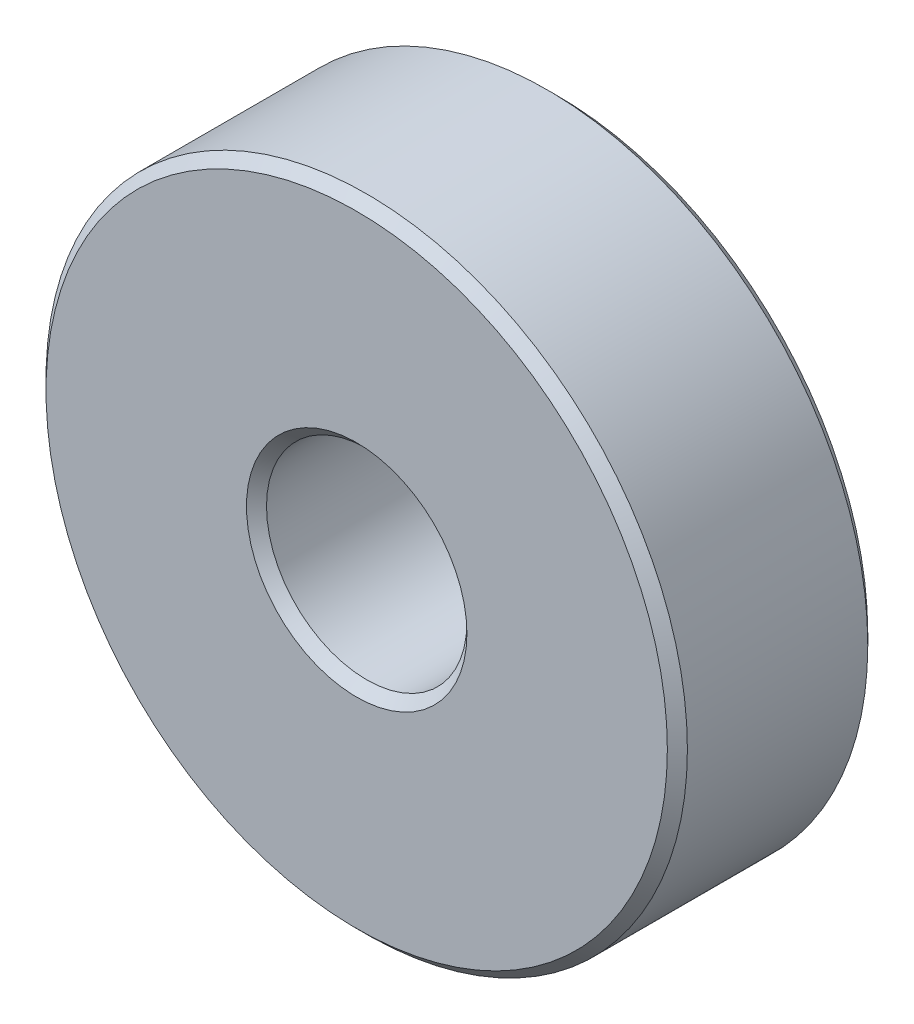
ISO-10303-21;
HEADER;
FILE_DESCRIPTION(('STEP AP214'),'2;1');
FILE_NAME('part.step','',(''),(''),'','','');
FILE_SCHEMA(('AUTOMOTIVE_DESIGN { 1 0 10303 214 1 1 1 1 }'));
ENDSEC;
DATA;
#1=APPLICATION_CONTEXT('core data for automotive mechanical design processes');
#2=APPLICATION_PROTOCOL_DEFINITION('international standard','automotive_design',2000,#1);
#3=PRODUCT_CONTEXT('',#1,'mechanical');
#4=PRODUCT('Part','Part','',(#3));
#5=PRODUCT_RELATED_PRODUCT_CATEGORY('part','',(#4));
#6=PRODUCT_DEFINITION_FORMATION('','',#4);
#7=PRODUCT_DEFINITION_CONTEXT('part definition',#1,'design');
#8=PRODUCT_DEFINITION('design','',#6,#7);
#9=PRODUCT_DEFINITION_SHAPE('','',#8);
#10=(LENGTH_UNIT() NAMED_UNIT(*) SI_UNIT(.MILLI.,.METRE.));
#11=(NAMED_UNIT(*) PLANE_ANGLE_UNIT() SI_UNIT($,.RADIAN.));
#12=(NAMED_UNIT(*) SI_UNIT($,.STERADIAN.) SOLID_ANGLE_UNIT());
#13=UNCERTAINTY_MEASURE_WITH_UNIT(LENGTH_MEASURE(1.E-05),#10,'distance_accuracy_value','');
#14=(GEOMETRIC_REPRESENTATION_CONTEXT(3) GLOBAL_UNCERTAINTY_ASSIGNED_CONTEXT((#13)) GLOBAL_UNIT_ASSIGNED_CONTEXT((#10,
#11,#12)) REPRESENTATION_CONTEXT('',''));
#15=CARTESIAN_POINT('',(0.,0.,0.));
#16=DIRECTION('',(0.,0.,1.));
#17=DIRECTION('',(1.,0.,0.));
#18=AXIS2_PLACEMENT_3D('',#15,#16,#17);
#19=CARTESIAN_POINT('',(0.,0.,2.5));
#20=DIRECTION('',(0.,0.,1.));
#21=DIRECTION('',(1.,0.,0.));
#22=AXIS2_PLACEMENT_3D('',#19,#20,#21);
#23=PLANE('',#22);
#24=CARTESIAN_POINT('',(0.,0.,2.5));
#25=DIRECTION('',(0.,0.,1.));
#26=DIRECTION('',(1.,0.,0.));
#27=AXIS2_PLACEMENT_3D('',#24,#25,#26);
#28=CIRCLE('',#27,2.75);
#29=CARTESIAN_POINT('',(2.75,0.,2.5));
#30=VERTEX_POINT('',#29);
#31=EDGE_CURVE('E41',#30,#30,#28,.F.);
#32=ORIENTED_EDGE('',*,*,#31,.T.);
#33=EDGE_LOOP('',(#32));
#34=FACE_BOUND('',#33,.T.);
#35=CARTESIAN_POINT('',(0.,0.,2.5));
#36=DIRECTION('',(0.,0.,1.));
#37=DIRECTION('',(1.,0.,0.));
#38=AXIS2_PLACEMENT_3D('',#35,#36,#37);
#39=CIRCLE('',#38,7.75);
#40=CARTESIAN_POINT('',(7.75,0.,2.5));
#41=VERTEX_POINT('',#40);
#42=EDGE_CURVE('E45',#41,#41,#39,.T.);
#43=ORIENTED_EDGE('',*,*,#42,.T.);
#44=EDGE_LOOP('',(#43));
#45=FACE_BOUND('',#44,.T.);
#46=ADVANCED_FACE('F30',(#34,#45),#23,.T.);
#47=CARTESIAN_POINT('',(0.,0.,-2.5));
#48=DIRECTION('',(0.,0.,1.));
#49=DIRECTION('',(1.,0.,0.));
#50=AXIS2_PLACEMENT_3D('',#47,#48,#49);
#51=PLANE('',#50);
#52=CARTESIAN_POINT('',(0.,0.,-2.5));
#53=DIRECTION('',(0.,0.,1.));
#54=DIRECTION('',(1.,0.,0.));
#55=AXIS2_PLACEMENT_3D('',#52,#53,#54);
#56=CIRCLE('',#55,2.75);
#57=CARTESIAN_POINT('',(2.75,0.,-2.5));
#58=VERTEX_POINT('',#57);
#59=EDGE_CURVE('E56',#58,#58,#56,.T.);
#60=ORIENTED_EDGE('',*,*,#59,.T.);
#61=EDGE_LOOP('',(#60));
#62=FACE_BOUND('',#61,.T.);
#63=CARTESIAN_POINT('',(0.,0.,-2.5));
#64=DIRECTION('',(0.,0.,1.));
#65=DIRECTION('',(1.,0.,0.));
#66=AXIS2_PLACEMENT_3D('',#63,#64,#65);
#67=CIRCLE('',#66,7.75);
#68=CARTESIAN_POINT('',(7.75,0.,-2.5));
#69=VERTEX_POINT('',#68);
#70=EDGE_CURVE('E59',#69,#69,#67,.F.);
#71=ORIENTED_EDGE('',*,*,#70,.T.);
#72=EDGE_LOOP('',(#71));
#73=FACE_BOUND('',#72,.T.);
#74=ADVANCED_FACE('F63',(#62,#73),#51,.F.);
#75=CARTESIAN_POINT('',(0.,0.,2.5));
#76=DIRECTION('',(0.,0.,-1.));
#77=DIRECTION('',(-1.,0.,0.));
#78=AXIS2_PLACEMENT_3D('',#75,#76,#77);
#79=CYLINDRICAL_SURFACE('',#78,8.);
#80=CARTESIAN_POINT('',(0.,0.,-2.25));
#81=DIRECTION('',(0.,0.,1.));
#82=DIRECTION('',(1.,0.,0.));
#83=AXIS2_PLACEMENT_3D('',#80,#81,#82);
#84=CIRCLE('',#83,8.);
#85=CARTESIAN_POINT('',(8.,0.,-2.25));
#86=VERTEX_POINT('',#85);
#87=EDGE_CURVE('E10',#86,#86,#84,.T.);
#88=ORIENTED_EDGE('',*,*,#87,.T.);
#89=EDGE_LOOP('',(#88));
#90=FACE_BOUND('',#89,.T.);
#91=CARTESIAN_POINT('',(0.,0.,2.25));
#92=DIRECTION('',(0.,0.,1.));
#93=DIRECTION('',(1.,0.,0.));
#94=AXIS2_PLACEMENT_3D('',#91,#92,#93);
#95=CIRCLE('',#94,8.);
#96=CARTESIAN_POINT('',(8.,0.,2.25));
#97=VERTEX_POINT('',#96);
#98=EDGE_CURVE('E37',#97,#97,#95,.F.);
#99=ORIENTED_EDGE('',*,*,#98,.T.);
#100=EDGE_LOOP('',(#99));
#101=FACE_BOUND('',#100,.T.);
#102=ADVANCED_FACE('F83',(#90,#101),#79,.T.);
#103=CARTESIAN_POINT('',(0.,0.,2.5));
#104=DIRECTION('',(0.,0.,-1.));
#105=DIRECTION('',(-1.,0.,0.));
#106=AXIS2_PLACEMENT_3D('',#103,#104,#105);
#107=CYLINDRICAL_SURFACE('',#106,2.5);
#108=CARTESIAN_POINT('',(0.,0.,-2.25));
#109=DIRECTION('',(0.,0.,1.));
#110=DIRECTION('',(1.,0.,0.));
#111=AXIS2_PLACEMENT_3D('',#108,#109,#110);
#112=CIRCLE('',#111,2.5);
#113=CARTESIAN_POINT('',(2.5,0.,-2.25));
#114=VERTEX_POINT('',#113);
#115=EDGE_CURVE('E50',#114,#114,#112,.F.);
#116=ORIENTED_EDGE('',*,*,#115,.T.);
#117=EDGE_LOOP('',(#116));
#118=FACE_BOUND('',#117,.T.);
#119=CARTESIAN_POINT('',(0.,0.,2.25));
#120=DIRECTION('',(0.,0.,1.));
#121=DIRECTION('',(1.,0.,0.));
#122=AXIS2_PLACEMENT_3D('',#119,#120,#121);
#123=CIRCLE('',#122,2.5);
#124=CARTESIAN_POINT('',(2.5,0.,2.25));
#125=VERTEX_POINT('',#124);
#126=EDGE_CURVE('E53',#125,#125,#123,.T.);
#127=ORIENTED_EDGE('',*,*,#126,.T.);
#128=EDGE_LOOP('',(#127));
#129=FACE_BOUND('',#128,.T.);
#130=ADVANCED_FACE('F88',(#118,#129),#107,.F.);
#131=CARTESIAN_POINT('',(0.,0.,-2.5));
#132=DIRECTION('',(0.,0.,-1.));
#133=DIRECTION('',(-1.,0.,0.));
#134=AXIS2_PLACEMENT_3D('',#131,#132,#133);
#135=CONICAL_SURFACE('',#134,2.75,0.785398163397452);
#136=ORIENTED_EDGE('',*,*,#115,.F.);
#137=EDGE_LOOP('',(#136));
#138=FACE_BOUND('',#137,.T.);
#139=ORIENTED_EDGE('',*,*,#59,.F.);
#140=EDGE_LOOP('',(#139));
#141=FACE_BOUND('',#140,.T.);
#142=ADVANCED_FACE('F74',(#138,#141),#135,.F.);
#143=CARTESIAN_POINT('',(0.,0.,2.25));
#144=DIRECTION('',(0.,0.,1.));
#145=DIRECTION('',(1.,0.,0.));
#146=AXIS2_PLACEMENT_3D('',#143,#144,#145);
#147=CONICAL_SURFACE('',#146,2.5,0.785398163397445);
#148=ORIENTED_EDGE('',*,*,#31,.F.);
#149=EDGE_LOOP('',(#148));
#150=FACE_BOUND('',#149,.T.);
#151=ORIENTED_EDGE('',*,*,#126,.F.);
#152=EDGE_LOOP('',(#151));
#153=FACE_BOUND('',#152,.T.);
#154=ADVANCED_FACE('F68',(#150,#153),#147,.F.);
#155=CARTESIAN_POINT('',(0.,0.,-2.25));
#156=DIRECTION('',(0.,0.,1.));
#157=DIRECTION('',(1.,0.,0.));
#158=AXIS2_PLACEMENT_3D('',#155,#156,#157);
#159=CONICAL_SURFACE('',#158,8.,0.785398163397448);
#160=ORIENTED_EDGE('',*,*,#70,.F.);
#161=EDGE_LOOP('',(#160));
#162=FACE_BOUND('',#161,.T.);
#163=ORIENTED_EDGE('',*,*,#87,.F.);
#164=EDGE_LOOP('',(#163));
#165=FACE_BOUND('',#164,.T.);
#166=ADVANCED_FACE('F65',(#162,#165),#159,.T.);
#167=CARTESIAN_POINT('',(0.,0.,2.5));
#168=DIRECTION('',(0.,0.,-1.));
#169=DIRECTION('',(-1.,0.,0.));
#170=AXIS2_PLACEMENT_3D('',#167,#168,#169);
#171=CONICAL_SURFACE('',#170,7.75,0.785398163397441);
#172=ORIENTED_EDGE('',*,*,#98,.F.);
#173=EDGE_LOOP('',(#172));
#174=FACE_BOUND('',#173,.T.);
#175=ORIENTED_EDGE('',*,*,#42,.F.);
#176=EDGE_LOOP('',(#175));
#177=FACE_BOUND('',#176,.T.);
#178=ADVANCED_FACE('F32',(#174,#177),#171,.T.);
#179=CLOSED_SHELL('',(#46,#74,#102,#130,#142,#154,#166,#178));
#180=MANIFOLD_SOLID_BREP('B2',#179);
#181=ADVANCED_BREP_SHAPE_REPRESENTATION('',(#18,#180),#14);
#182=SHAPE_DEFINITION_REPRESENTATION(#9,#181);
ENDSEC;
END-ISO-10303-21;
